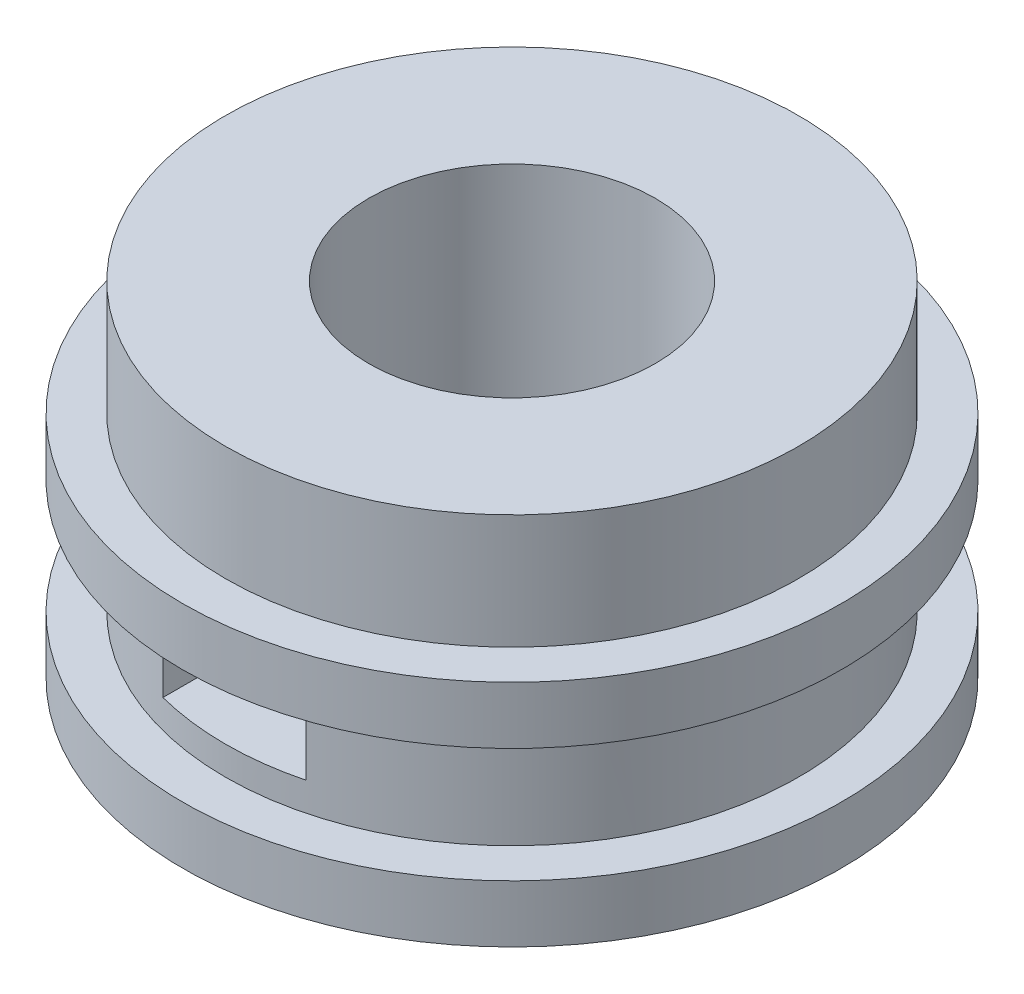
ISO-10303-21;
HEADER;
FILE_DESCRIPTION(('STEP AP214'),'2;1');
FILE_NAME('part.step','',(''),(''),'','','');
FILE_SCHEMA(('AUTOMOTIVE_DESIGN { 1 0 10303 214 1 1 1 1 }'));
ENDSEC;
DATA;
#1=APPLICATION_CONTEXT('core data for automotive mechanical design processes');
#2=APPLICATION_PROTOCOL_DEFINITION('international standard','automotive_design',2000,#1);
#3=PRODUCT_CONTEXT('',#1,'mechanical');
#4=PRODUCT('Part','Part','',(#3));
#5=PRODUCT_RELATED_PRODUCT_CATEGORY('part','',(#4));
#6=PRODUCT_DEFINITION_FORMATION('','',#4);
#7=PRODUCT_DEFINITION_CONTEXT('part definition',#1,'design');
#8=PRODUCT_DEFINITION('design','',#6,#7);
#9=PRODUCT_DEFINITION_SHAPE('','',#8);
#10=(LENGTH_UNIT() NAMED_UNIT(*) SI_UNIT(.MILLI.,.METRE.));
#11=(NAMED_UNIT(*) PLANE_ANGLE_UNIT() SI_UNIT($,.RADIAN.));
#12=(NAMED_UNIT(*) SI_UNIT($,.STERADIAN.) SOLID_ANGLE_UNIT());
#13=UNCERTAINTY_MEASURE_WITH_UNIT(LENGTH_MEASURE(1.E-05),#10,'distance_accuracy_value','');
#14=(GEOMETRIC_REPRESENTATION_CONTEXT(3) GLOBAL_UNCERTAINTY_ASSIGNED_CONTEXT((#13)) GLOBAL_UNIT_ASSIGNED_CONTEXT((#10,
#11,#12)) REPRESENTATION_CONTEXT('',''));
#15=CARTESIAN_POINT('',(0.,0.,0.));
#16=DIRECTION('',(0.,0.,1.));
#17=DIRECTION('',(1.,0.,0.));
#18=AXIS2_PLACEMENT_3D('',#15,#16,#17);
#19=CARTESIAN_POINT('',(0.,-2.,0.));
#20=DIRECTION('',(0.,1.,0.));
#21=DIRECTION('',(0.,0.,1.));
#22=AXIS2_PLACEMENT_3D('',#19,#20,#21);
#23=CYLINDRICAL_SURFACE('',#22,5.);
#24=CARTESIAN_POINT('',(0.,-1.,0.));
#25=DIRECTION('',(0.,-1.,0.));
#26=DIRECTION('',(0.,0.,-1.));
#27=AXIS2_PLACEMENT_3D('',#24,#25,#26);
#28=CIRCLE('',#27,5.);
#29=CARTESIAN_POINT('',(0.,-1.,-5.));
#30=VERTEX_POINT('',#29);
#31=EDGE_CURVE('E195',#30,#30,#28,.T.);
#32=ORIENTED_EDGE('',*,*,#31,.F.);
#33=EDGE_LOOP('',(#32));
#34=FACE_BOUND('',#33,.T.);
#35=CARTESIAN_POINT('',(0.,-0.5,0.));
#36=DIRECTION('',(0.,-1.,0.));
#37=DIRECTION('',(1.,0.,0.));
#38=AXIS2_PLACEMENT_3D('',#35,#36,#37);
#39=CIRCLE('',#38,5.);
#40=CARTESIAN_POINT('',(1.25,-0.5,-4.84122918275927));
#41=VERTEX_POINT('',#40);
#42=CARTESIAN_POINT('',(-1.25,-0.5,-4.84122918275927));
#43=VERTEX_POINT('',#42);
#44=EDGE_CURVE('E122',#41,#43,#39,.F.);
#45=ORIENTED_EDGE('',*,*,#44,.F.);
#46=DIRECTION('',(0.,1.,0.));
#47=VECTOR('',#46,1.);
#48=CARTESIAN_POINT('',(1.25,-2.,-4.84122918275927));
#49=LINE('',#48,#47);
#50=CARTESIAN_POINT('',(1.25,0.5,-4.84122918275927));
#51=VERTEX_POINT('',#50);
#52=EDGE_CURVE('E108',#51,#41,#49,.F.);
#53=ORIENTED_EDGE('',*,*,#52,.F.);
#54=CARTESIAN_POINT('',(0.,0.5,0.));
#55=DIRECTION('',(0.,1.,0.));
#56=DIRECTION('',(0.,0.,1.));
#57=AXIS2_PLACEMENT_3D('',#54,#55,#56);
#58=CIRCLE('',#57,5.);
#59=CARTESIAN_POINT('',(-1.25,0.5,-4.84122918275927));
#60=VERTEX_POINT('',#59);
#61=EDGE_CURVE('E138',#60,#51,#58,.F.);
#62=ORIENTED_EDGE('',*,*,#61,.F.);
#63=DIRECTION('',(0.,1.,0.));
#64=VECTOR('',#63,1.);
#65=CARTESIAN_POINT('',(-1.25,-2.,-4.84122918275927));
#66=LINE('',#65,#64);
#67=EDGE_CURVE('E129',#43,#60,#66,.T.);
#68=ORIENTED_EDGE('',*,*,#67,.F.);
#69=EDGE_LOOP('',(#45,#53,#62,#68));
#70=FACE_BOUND('',#69,.T.);
#71=CARTESIAN_POINT('',(-1.25,-0.5,4.84122918275927));
#72=VERTEX_POINT('',#71);
#73=CARTESIAN_POINT('',(1.25,-0.5,4.84122918275927));
#74=VERTEX_POINT('',#73);
#75=EDGE_CURVE('E130',#72,#74,#39,.F.);
#76=ORIENTED_EDGE('',*,*,#75,.F.);
#77=DIRECTION('',(0.,1.,0.));
#78=VECTOR('',#77,1.);
#79=CARTESIAN_POINT('',(-1.25,-2.,4.84122918275927));
#80=LINE('',#79,#78);
#81=CARTESIAN_POINT('',(-1.25,0.5,4.84122918275927));
#82=VERTEX_POINT('',#81);
#83=EDGE_CURVE('E141',#82,#72,#80,.F.);
#84=ORIENTED_EDGE('',*,*,#83,.F.);
#85=CARTESIAN_POINT('',(1.25,0.5,4.84122918275927));
#86=VERTEX_POINT('',#85);
#87=EDGE_CURVE('E118',#86,#82,#58,.F.);
#88=ORIENTED_EDGE('',*,*,#87,.F.);
#89=DIRECTION('',(0.,1.,0.));
#90=VECTOR('',#89,1.);
#91=CARTESIAN_POINT('',(1.25,-2.,4.84122918275927));
#92=LINE('',#91,#90);
#93=EDGE_CURVE('E119',#74,#86,#92,.T.);
#94=ORIENTED_EDGE('',*,*,#93,.F.);
#95=EDGE_LOOP('',(#76,#84,#88,#94));
#96=FACE_BOUND('',#95,.T.);
#97=CARTESIAN_POINT('',(0.,1.,0.));
#98=DIRECTION('',(0.,1.,0.));
#99=DIRECTION('',(0.,0.,1.));
#100=AXIS2_PLACEMENT_3D('',#97,#98,#99);
#101=CIRCLE('',#100,5.);
#102=CARTESIAN_POINT('',(0.,1.,5.));
#103=VERTEX_POINT('',#102);
#104=EDGE_CURVE('E203',#103,#103,#101,.T.);
#105=ORIENTED_EDGE('',*,*,#104,.F.);
#106=EDGE_LOOP('',(#105));
#107=FACE_BOUND('',#106,.T.);
#108=ADVANCED_FACE('F42',(#34,#70,#96,#107),#23,.T.);
#109=CARTESIAN_POINT('',(0.,2.,0.));
#110=DIRECTION('',(0.,1.,0.));
#111=DIRECTION('',(0.,0.,1.));
#112=AXIS2_PLACEMENT_3D('',#109,#110,#111);
#113=CIRCLE('',#112,5.);
#114=CARTESIAN_POINT('',(0.,2.,5.));
#115=VERTEX_POINT('',#114);
#116=EDGE_CURVE('E11',#115,#115,#113,.F.);
#117=ORIENTED_EDGE('',*,*,#116,.F.);
#118=EDGE_LOOP('',(#117));
#119=FACE_BOUND('',#118,.T.);
#120=CARTESIAN_POINT('',(0.,4.,0.));
#121=DIRECTION('',(0.,1.,0.));
#122=DIRECTION('',(0.,0.,1.));
#123=AXIS2_PLACEMENT_3D('',#120,#121,#122);
#124=CIRCLE('',#123,5.);
#125=CARTESIAN_POINT('',(0.,4.,5.));
#126=VERTEX_POINT('',#125);
#127=EDGE_CURVE('E146',#126,#126,#124,.T.);
#128=ORIENTED_EDGE('',*,*,#127,.F.);
#129=EDGE_LOOP('',(#128));
#130=FACE_BOUND('',#129,.T.);
#131=ADVANCED_FACE('F44',(#119,#130),#23,.T.);
#132=CARTESIAN_POINT('',(0.,-2.,0.));
#133=DIRECTION('',(0.,1.,0.));
#134=DIRECTION('',(0.,0.,1.));
#135=AXIS2_PLACEMENT_3D('',#132,#133,#134);
#136=PLANE('',#135);
#137=CARTESIAN_POINT('',(0.,-2.,0.));
#138=DIRECTION('',(0.,1.,0.));
#139=DIRECTION('',(0.,0.,1.));
#140=AXIS2_PLACEMENT_3D('',#137,#138,#139);
#141=CIRCLE('',#140,2.5);
#142=CARTESIAN_POINT('',(0.,-2.,2.5));
#143=VERTEX_POINT('',#142);
#144=EDGE_CURVE('E149',#143,#143,#141,.T.);
#145=ORIENTED_EDGE('',*,*,#144,.T.);
#146=EDGE_LOOP('',(#145));
#147=FACE_BOUND('',#146,.T.);
#148=CARTESIAN_POINT('',(0.,-2.,0.));
#149=DIRECTION('',(0.,-1.,0.));
#150=DIRECTION('',(0.,0.,-1.));
#151=AXIS2_PLACEMENT_3D('',#148,#149,#150);
#152=CIRCLE('',#151,5.75);
#153=CARTESIAN_POINT('',(0.,-2.,-5.75));
#154=VERTEX_POINT('',#153);
#155=EDGE_CURVE('E182',#154,#154,#152,.T.);
#156=ORIENTED_EDGE('',*,*,#155,.T.);
#157=EDGE_LOOP('',(#156));
#158=FACE_BOUND('',#157,.T.);
#159=ADVANCED_FACE('F216',(#147,#158),#136,.F.);
#160=CARTESIAN_POINT('',(0.,-2.,0.));
#161=DIRECTION('',(0.,1.,0.));
#162=DIRECTION('',(0.,0.,1.));
#163=AXIS2_PLACEMENT_3D('',#160,#161,#162);
#164=CYLINDRICAL_SURFACE('',#163,2.5);
#165=CARTESIAN_POINT('',(0.,-0.5,0.));
#166=DIRECTION('',(0.,-1.,0.));
#167=DIRECTION('',(1.,0.,0.));
#168=AXIS2_PLACEMENT_3D('',#165,#166,#167);
#169=CIRCLE('',#168,2.5);
#170=CARTESIAN_POINT('',(1.25,-0.5,-2.1650635094611));
#171=VERTEX_POINT('',#170);
#172=CARTESIAN_POINT('',(-1.25,-0.5,-2.1650635094611));
#173=VERTEX_POINT('',#172);
#174=EDGE_CURVE('E124',#171,#173,#169,.F.);
#175=ORIENTED_EDGE('',*,*,#174,.T.);
#176=DIRECTION('',(0.,1.,0.));
#177=VECTOR('',#176,1.);
#178=CARTESIAN_POINT('',(-1.25,-2.,-2.1650635094611));
#179=LINE('',#178,#177);
#180=CARTESIAN_POINT('',(-1.25,0.5,-2.1650635094611));
#181=VERTEX_POINT('',#180);
#182=EDGE_CURVE('E50',#173,#181,#179,.T.);
#183=ORIENTED_EDGE('',*,*,#182,.T.);
#184=CARTESIAN_POINT('',(0.,0.5,0.));
#185=DIRECTION('',(0.,1.,0.));
#186=DIRECTION('',(0.,0.,1.));
#187=AXIS2_PLACEMENT_3D('',#184,#185,#186);
#188=CIRCLE('',#187,2.5);
#189=CARTESIAN_POINT('',(1.25,0.5,-2.1650635094611));
#190=VERTEX_POINT('',#189);
#191=EDGE_CURVE('E162',#181,#190,#188,.F.);
#192=ORIENTED_EDGE('',*,*,#191,.T.);
#193=DIRECTION('',(0.,1.,0.));
#194=VECTOR('',#193,1.);
#195=CARTESIAN_POINT('',(1.25,-2.,-2.1650635094611));
#196=LINE('',#195,#194);
#197=EDGE_CURVE('E165',#190,#171,#196,.F.);
#198=ORIENTED_EDGE('',*,*,#197,.T.);
#199=EDGE_LOOP('',(#175,#183,#192,#198));
#200=FACE_BOUND('',#199,.T.);
#201=CARTESIAN_POINT('',(1.25,0.5,2.1650635094611));
#202=VERTEX_POINT('',#201);
#203=CARTESIAN_POINT('',(-1.25,0.5,2.1650635094611));
#204=VERTEX_POINT('',#203);
#205=EDGE_CURVE('E158',#202,#204,#188,.F.);
#206=ORIENTED_EDGE('',*,*,#205,.T.);
#207=DIRECTION('',(0.,1.,0.));
#208=VECTOR('',#207,1.);
#209=CARTESIAN_POINT('',(-1.25,-2.,2.1650635094611));
#210=LINE('',#209,#208);
#211=CARTESIAN_POINT('',(-1.25,-0.5,2.1650635094611));
#212=VERTEX_POINT('',#211);
#213=EDGE_CURVE('E161',#204,#212,#210,.F.);
#214=ORIENTED_EDGE('',*,*,#213,.T.);
#215=CARTESIAN_POINT('',(1.25,-0.5,2.1650635094611));
#216=VERTEX_POINT('',#215);
#217=EDGE_CURVE('E152',#212,#216,#169,.F.);
#218=ORIENTED_EDGE('',*,*,#217,.T.);
#219=DIRECTION('',(0.,1.,0.));
#220=VECTOR('',#219,1.);
#221=CARTESIAN_POINT('',(1.25,-2.,2.1650635094611));
#222=LINE('',#221,#220);
#223=EDGE_CURVE('E155',#216,#202,#222,.T.);
#224=ORIENTED_EDGE('',*,*,#223,.T.);
#225=EDGE_LOOP('',(#206,#214,#218,#224));
#226=FACE_BOUND('',#225,.T.);
#227=ORIENTED_EDGE('',*,*,#144,.F.);
#228=EDGE_LOOP('',(#227));
#229=FACE_BOUND('',#228,.T.);
#230=CARTESIAN_POINT('',(0.,4.,0.));
#231=DIRECTION('',(0.,1.,0.));
#232=DIRECTION('',(0.,0.,1.));
#233=AXIS2_PLACEMENT_3D('',#230,#231,#232);
#234=CIRCLE('',#233,2.5);
#235=CARTESIAN_POINT('',(0.,4.,2.5));
#236=VERTEX_POINT('',#235);
#237=EDGE_CURVE('E143',#236,#236,#234,.T.);
#238=ORIENTED_EDGE('',*,*,#237,.T.);
#239=EDGE_LOOP('',(#238));
#240=FACE_BOUND('',#239,.T.);
#241=ADVANCED_FACE('F169',(#200,#226,#229,#240),#164,.F.);
#242=CARTESIAN_POINT('',(0.,4.,0.));
#243=DIRECTION('',(0.,1.,0.));
#244=DIRECTION('',(0.,0.,1.));
#245=AXIS2_PLACEMENT_3D('',#242,#243,#244);
#246=PLANE('',#245);
#247=ORIENTED_EDGE('',*,*,#127,.T.);
#248=EDGE_LOOP('',(#247));
#249=FACE_BOUND('',#248,.T.);
#250=ORIENTED_EDGE('',*,*,#237,.F.);
#251=EDGE_LOOP('',(#250));
#252=FACE_BOUND('',#251,.T.);
#253=ADVANCED_FACE('F250',(#249,#252),#246,.T.);
#254=CARTESIAN_POINT('',(-1.25,-0.5,-5.));
#255=DIRECTION('',(0.,-1.,0.));
#256=DIRECTION('',(1.,0.,0.));
#257=AXIS2_PLACEMENT_3D('',#254,#255,#256);
#258=PLANE('',#257);
#259=ORIENTED_EDGE('',*,*,#75,.T.);
#260=DIRECTION('',(0.,0.,1.));
#261=VECTOR('',#260,1.);
#262=CARTESIAN_POINT('',(1.25,-0.5,-5.));
#263=LINE('',#262,#261);
#264=EDGE_CURVE('E65',#216,#74,#263,.T.);
#265=ORIENTED_EDGE('',*,*,#264,.F.);
#266=ORIENTED_EDGE('',*,*,#217,.F.);
#267=DIRECTION('',(0.,0.,1.));
#268=VECTOR('',#267,1.);
#269=CARTESIAN_POINT('',(-1.25,-0.5,-5.));
#270=LINE('',#269,#268);
#271=EDGE_CURVE('E136',#212,#72,#270,.T.);
#272=ORIENTED_EDGE('',*,*,#271,.T.);
#273=EDGE_LOOP('',(#259,#265,#266,#272));
#274=FACE_BOUND('',#273,.T.);
#275=ADVANCED_FACE('F245',(#274),#258,.F.);
#276=CARTESIAN_POINT('',(1.25,0.5,-5.));
#277=DIRECTION('',(1.,0.,0.));
#278=DIRECTION('',(0.,0.,-1.));
#279=AXIS2_PLACEMENT_3D('',#276,#277,#278);
#280=PLANE('',#279);
#281=ORIENTED_EDGE('',*,*,#93,.T.);
#282=DIRECTION('',(0.,0.,1.));
#283=VECTOR('',#282,1.);
#284=CARTESIAN_POINT('',(1.25,0.5,-5.));
#285=LINE('',#284,#283);
#286=EDGE_CURVE('E125',#202,#86,#285,.T.);
#287=ORIENTED_EDGE('',*,*,#286,.F.);
#288=ORIENTED_EDGE('',*,*,#223,.F.);
#289=ORIENTED_EDGE('',*,*,#264,.T.);
#290=EDGE_LOOP('',(#281,#287,#288,#289));
#291=FACE_BOUND('',#290,.T.);
#292=ADVANCED_FACE('F242',(#291),#280,.F.);
#293=CARTESIAN_POINT('',(-1.25,0.5,-5.));
#294=DIRECTION('',(0.,1.,0.));
#295=DIRECTION('',(0.,0.,1.));
#296=AXIS2_PLACEMENT_3D('',#293,#294,#295);
#297=PLANE('',#296);
#298=ORIENTED_EDGE('',*,*,#87,.T.);
#299=DIRECTION('',(0.,0.,1.));
#300=VECTOR('',#299,1.);
#301=CARTESIAN_POINT('',(-1.25,0.5,-5.));
#302=LINE('',#301,#300);
#303=EDGE_CURVE('E177',#204,#82,#302,.T.);
#304=ORIENTED_EDGE('',*,*,#303,.F.);
#305=ORIENTED_EDGE('',*,*,#205,.F.);
#306=ORIENTED_EDGE('',*,*,#286,.T.);
#307=EDGE_LOOP('',(#298,#304,#305,#306));
#308=FACE_BOUND('',#307,.T.);
#309=ADVANCED_FACE('F239',(#308),#297,.F.);
#310=CARTESIAN_POINT('',(-1.25,0.5,-5.));
#311=DIRECTION('',(-1.,0.,0.));
#312=DIRECTION('',(0.,0.,1.));
#313=AXIS2_PLACEMENT_3D('',#310,#311,#312);
#314=PLANE('',#313);
#315=ORIENTED_EDGE('',*,*,#83,.T.);
#316=ORIENTED_EDGE('',*,*,#271,.F.);
#317=ORIENTED_EDGE('',*,*,#213,.F.);
#318=ORIENTED_EDGE('',*,*,#303,.T.);
#319=EDGE_LOOP('',(#315,#316,#317,#318));
#320=FACE_BOUND('',#319,.T.);
#321=ADVANCED_FACE('F246',(#320),#314,.F.);
#322=ORIENTED_EDGE('',*,*,#67,.T.);
#323=EDGE_CURVE('E134',#60,#181,#302,.T.);
#324=ORIENTED_EDGE('',*,*,#323,.T.);
#325=ORIENTED_EDGE('',*,*,#182,.F.);
#326=EDGE_CURVE('E57',#43,#173,#270,.T.);
#327=ORIENTED_EDGE('',*,*,#326,.F.);
#328=EDGE_LOOP('',(#322,#324,#325,#327));
#329=FACE_BOUND('',#328,.T.);
#330=ADVANCED_FACE('F176',(#329),#314,.F.);
#331=ORIENTED_EDGE('',*,*,#61,.T.);
#332=EDGE_CURVE('E114',#51,#190,#285,.T.);
#333=ORIENTED_EDGE('',*,*,#332,.T.);
#334=ORIENTED_EDGE('',*,*,#191,.F.);
#335=ORIENTED_EDGE('',*,*,#323,.F.);
#336=EDGE_LOOP('',(#331,#333,#334,#335));
#337=FACE_BOUND('',#336,.T.);
#338=ADVANCED_FACE('F174',(#337),#297,.F.);
#339=ORIENTED_EDGE('',*,*,#52,.T.);
#340=EDGE_CURVE('E111',#41,#171,#263,.T.);
#341=ORIENTED_EDGE('',*,*,#340,.T.);
#342=ORIENTED_EDGE('',*,*,#197,.F.);
#343=ORIENTED_EDGE('',*,*,#332,.F.);
#344=EDGE_LOOP('',(#339,#341,#342,#343));
#345=FACE_BOUND('',#344,.T.);
#346=ADVANCED_FACE('F110',(#345),#280,.F.);
#347=ORIENTED_EDGE('',*,*,#44,.T.);
#348=ORIENTED_EDGE('',*,*,#326,.T.);
#349=ORIENTED_EDGE('',*,*,#174,.F.);
#350=ORIENTED_EDGE('',*,*,#340,.F.);
#351=EDGE_LOOP('',(#347,#348,#349,#350));
#352=FACE_BOUND('',#351,.T.);
#353=ADVANCED_FACE('F121',(#352),#258,.F.);
#354=CARTESIAN_POINT('',(0.,-1.,0.));
#355=DIRECTION('',(0.,-1.,0.));
#356=DIRECTION('',(0.,0.,-1.));
#357=AXIS2_PLACEMENT_3D('',#354,#355,#356);
#358=CYLINDRICAL_SURFACE('',#357,5.75);
#359=CARTESIAN_POINT('',(0.,-1.,0.));
#360=DIRECTION('',(0.,-1.,0.));
#361=DIRECTION('',(0.,0.,-1.));
#362=AXIS2_PLACEMENT_3D('',#359,#360,#361);
#363=CIRCLE('',#362,5.75);
#364=CARTESIAN_POINT('',(0.,-1.,-5.75));
#365=VERTEX_POINT('',#364);
#366=EDGE_CURVE('E188',#365,#365,#363,.T.);
#367=ORIENTED_EDGE('',*,*,#366,.T.);
#368=EDGE_LOOP('',(#367));
#369=FACE_BOUND('',#368,.T.);
#370=ORIENTED_EDGE('',*,*,#155,.F.);
#371=EDGE_LOOP('',(#370));
#372=FACE_BOUND('',#371,.T.);
#373=ADVANCED_FACE('F224',(#369,#372),#358,.T.);
#374=CARTESIAN_POINT('',(0.,-1.,0.));
#375=DIRECTION('',(0.,-1.,0.));
#376=DIRECTION('',(0.,0.,-1.));
#377=AXIS2_PLACEMENT_3D('',#374,#375,#376);
#378=PLANE('',#377);
#379=ORIENTED_EDGE('',*,*,#31,.T.);
#380=EDGE_LOOP('',(#379));
#381=FACE_BOUND('',#380,.T.);
#382=ORIENTED_EDGE('',*,*,#366,.F.);
#383=EDGE_LOOP('',(#382));
#384=FACE_BOUND('',#383,.T.);
#385=ADVANCED_FACE('F220',(#381,#384),#378,.F.);
#386=CARTESIAN_POINT('',(0.,2.,0.));
#387=DIRECTION('',(0.,1.,0.));
#388=DIRECTION('',(0.,0.,1.));
#389=AXIS2_PLACEMENT_3D('',#386,#387,#388);
#390=PLANE('',#389);
#391=CARTESIAN_POINT('',(0.,2.,0.));
#392=DIRECTION('',(0.,1.,0.));
#393=DIRECTION('',(0.,0.,1.));
#394=AXIS2_PLACEMENT_3D('',#391,#392,#393);
#395=CIRCLE('',#394,5.75);
#396=CARTESIAN_POINT('',(0.,2.,5.75));
#397=VERTEX_POINT('',#396);
#398=EDGE_CURVE('E199',#397,#397,#395,.T.);
#399=ORIENTED_EDGE('',*,*,#398,.T.);
#400=EDGE_LOOP('',(#399));
#401=FACE_BOUND('',#400,.T.);
#402=ORIENTED_EDGE('',*,*,#116,.T.);
#403=EDGE_LOOP('',(#402));
#404=FACE_BOUND('',#403,.T.);
#405=ADVANCED_FACE('F223',(#401,#404),#390,.T.);
#406=CARTESIAN_POINT('',(0.,1.,0.));
#407=DIRECTION('',(0.,1.,0.));
#408=DIRECTION('',(0.,0.,1.));
#409=AXIS2_PLACEMENT_3D('',#406,#407,#408);
#410=PLANE('',#409);
#411=CARTESIAN_POINT('',(0.,1.,0.));
#412=DIRECTION('',(0.,1.,0.));
#413=DIRECTION('',(0.,0.,1.));
#414=AXIS2_PLACEMENT_3D('',#411,#412,#413);
#415=CIRCLE('',#414,5.75);
#416=CARTESIAN_POINT('',(0.,1.,5.75));
#417=VERTEX_POINT('',#416);
#418=EDGE_CURVE('E200',#417,#417,#415,.T.);
#419=ORIENTED_EDGE('',*,*,#418,.F.);
#420=EDGE_LOOP('',(#419));
#421=FACE_BOUND('',#420,.T.);
#422=ORIENTED_EDGE('',*,*,#104,.T.);
#423=EDGE_LOOP('',(#422));
#424=FACE_BOUND('',#423,.T.);
#425=ADVANCED_FACE('F209',(#421,#424),#410,.F.);
#426=CARTESIAN_POINT('',(0.,2.,0.));
#427=DIRECTION('',(0.,-1.,0.));
#428=DIRECTION('',(0.,0.,-1.));
#429=AXIS2_PLACEMENT_3D('',#426,#427,#428);
#430=CYLINDRICAL_SURFACE('',#429,5.75);
#431=ORIENTED_EDGE('',*,*,#398,.F.);
#432=EDGE_LOOP('',(#431));
#433=FACE_BOUND('',#432,.T.);
#434=ORIENTED_EDGE('',*,*,#418,.T.);
#435=EDGE_LOOP('',(#434));
#436=FACE_BOUND('',#435,.T.);
#437=ADVANCED_FACE('F234',(#433,#436),#430,.T.);
#438=CLOSED_SHELL('',(#108,#131,#159,#241,#253,#275,#292,#309,#321,#330,#338,#346,#353,#373,
#385,#405,#425,#437));
#439=MANIFOLD_SOLID_BREP('B2',#438);
#440=ADVANCED_BREP_SHAPE_REPRESENTATION('',(#18,#439),#14);
#441=SHAPE_DEFINITION_REPRESENTATION(#9,#440);
ENDSEC;
END-ISO-10303-21;
